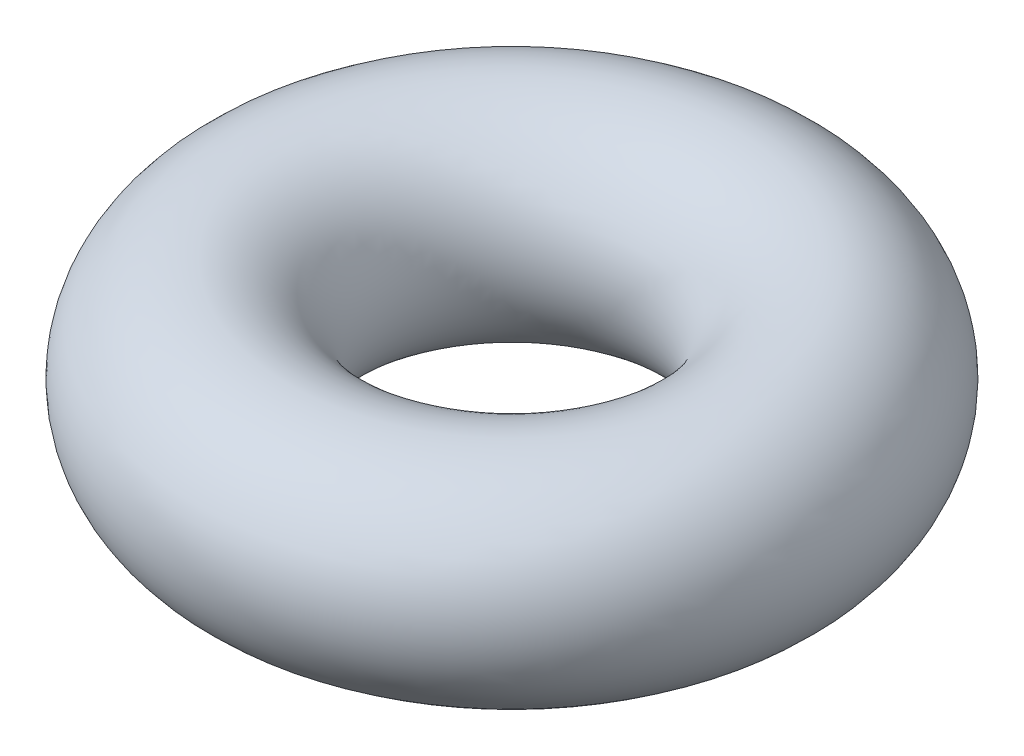
ISO-10303-21;
HEADER;
FILE_DESCRIPTION(('STEP AP214'),'2;1');
FILE_NAME('part.step','',(''),(''),'','','');
FILE_SCHEMA(('AUTOMOTIVE_DESIGN { 1 0 10303 214 1 1 1 1 }'));
ENDSEC;
DATA;
#1=APPLICATION_CONTEXT('core data for automotive mechanical design processes');
#2=APPLICATION_PROTOCOL_DEFINITION('international standard','automotive_design',2000,#1);
#3=PRODUCT_CONTEXT('',#1,'mechanical');
#4=PRODUCT('Part','Part','',(#3));
#5=PRODUCT_RELATED_PRODUCT_CATEGORY('part','',(#4));
#6=PRODUCT_DEFINITION_FORMATION('','',#4);
#7=PRODUCT_DEFINITION_CONTEXT('part definition',#1,'design');
#8=PRODUCT_DEFINITION('design','',#6,#7);
#9=PRODUCT_DEFINITION_SHAPE('','',#8);
#10=(LENGTH_UNIT() NAMED_UNIT(*) SI_UNIT(.MILLI.,.METRE.));
#11=(NAMED_UNIT(*) PLANE_ANGLE_UNIT() SI_UNIT($,.RADIAN.));
#12=(NAMED_UNIT(*) SI_UNIT($,.STERADIAN.) SOLID_ANGLE_UNIT());
#13=UNCERTAINTY_MEASURE_WITH_UNIT(LENGTH_MEASURE(1.E-05),#10,'distance_accuracy_value','');
#14=(GEOMETRIC_REPRESENTATION_CONTEXT(3) GLOBAL_UNCERTAINTY_ASSIGNED_CONTEXT((#13)) GLOBAL_UNIT_ASSIGNED_CONTEXT((#10,
#11,#12)) REPRESENTATION_CONTEXT('',''));
#15=CARTESIAN_POINT('',(0.,0.,0.));
#16=DIRECTION('',(0.,0.,1.));
#17=DIRECTION('',(1.,0.,0.));
#18=AXIS2_PLACEMENT_3D('',#15,#16,#17);
#19=CARTESIAN_POINT('',(0.,0.,0.));
#20=DIRECTION('',(0.,-1.,0.));
#21=DIRECTION('',(1.,0.,0.));
#22=AXIS2_PLACEMENT_3D('',#19,#20,#21);
#23=TOROIDAL_SURFACE('',#22,2.0475,0.952500000000001);
#24=CARTESIAN_POINT('',(3.,0.,0.));
#25=VERTEX_POINT('',#24);
#26=VERTEX_LOOP('',#25);
#27=FACE_BOUND('',#26,.T.);
#28=ADVANCED_FACE('F31',(#27),#23,.T.);
#29=CLOSED_SHELL('',(#28));
#30=MANIFOLD_SOLID_BREP('B2',#29);
#31=ADVANCED_BREP_SHAPE_REPRESENTATION('',(#18,#30),#14);
#32=SHAPE_DEFINITION_REPRESENTATION(#9,#31);
ENDSEC;
END-ISO-10303-21;
